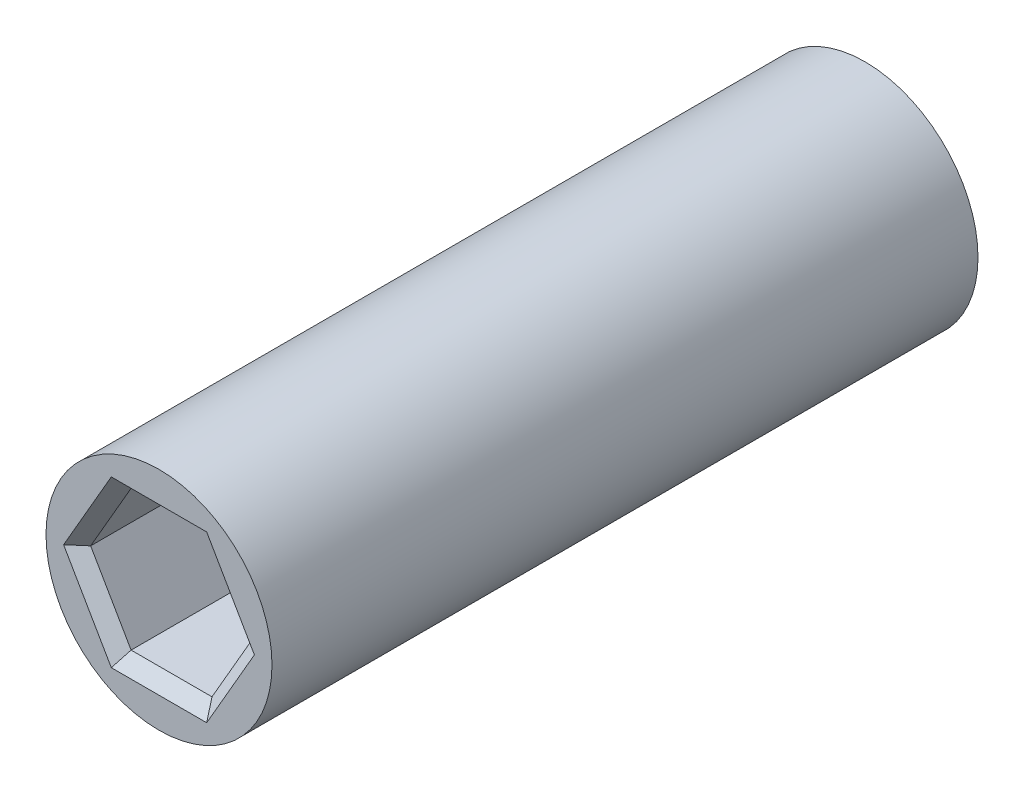
ISO-10303-21;
HEADER;
FILE_DESCRIPTION(('STEP AP214'),'2;1');
FILE_NAME('part.step','',(''),(''),'','','');
FILE_SCHEMA(('AUTOMOTIVE_DESIGN { 1 0 10303 214 1 1 1 1 }'));
ENDSEC;
DATA;
#1=APPLICATION_CONTEXT('core data for automotive mechanical design processes');
#2=APPLICATION_PROTOCOL_DEFINITION('international standard','automotive_design',2000,#1);
#3=PRODUCT_CONTEXT('',#1,'mechanical');
#4=PRODUCT('Part','Part','',(#3));
#5=PRODUCT_RELATED_PRODUCT_CATEGORY('part','',(#4));
#6=PRODUCT_DEFINITION_FORMATION('','',#4);
#7=PRODUCT_DEFINITION_CONTEXT('part definition',#1,'design');
#8=PRODUCT_DEFINITION('design','',#6,#7);
#9=PRODUCT_DEFINITION_SHAPE('','',#8);
#10=(LENGTH_UNIT() NAMED_UNIT(*) SI_UNIT(.MILLI.,.METRE.));
#11=(NAMED_UNIT(*) PLANE_ANGLE_UNIT() SI_UNIT($,.RADIAN.));
#12=(NAMED_UNIT(*) SI_UNIT($,.STERADIAN.) SOLID_ANGLE_UNIT());
#13=UNCERTAINTY_MEASURE_WITH_UNIT(LENGTH_MEASURE(1.E-05),#10,'distance_accuracy_value','');
#14=(GEOMETRIC_REPRESENTATION_CONTEXT(3) GLOBAL_UNCERTAINTY_ASSIGNED_CONTEXT((#13)) GLOBAL_UNIT_ASSIGNED_CONTEXT((#10,
#11,#12)) REPRESENTATION_CONTEXT('',''));
#15=CARTESIAN_POINT('',(0.,0.,0.));
#16=DIRECTION('',(0.,0.,1.));
#17=DIRECTION('',(1.,0.,0.));
#18=AXIS2_PLACEMENT_3D('',#15,#16,#17);
#19=CARTESIAN_POINT('',(0.,0.,0.));
#20=DIRECTION('',(0.,0.,1.));
#21=DIRECTION('',(1.,0.,0.));
#22=AXIS2_PLACEMENT_3D('',#19,#20,#21);
#23=CYLINDRICAL_SURFACE('',#22,4.5);
#24=CARTESIAN_POINT('',(0.,0.,-17.5));
#25=DIRECTION('',(0.,0.,1.));
#26=DIRECTION('',(1.,0.,0.));
#27=AXIS2_PLACEMENT_3D('',#24,#25,#26);
#28=CIRCLE('',#27,4.5);
#29=CARTESIAN_POINT('',(4.5,0.,-17.5));
#30=VERTEX_POINT('',#29);
#31=EDGE_CURVE('E257',#30,#30,#28,.T.);
#32=ORIENTED_EDGE('',*,*,#31,.F.);
#33=EDGE_LOOP('',(#32));
#34=FACE_BOUND('',#33,.T.);
#35=CARTESIAN_POINT('',(0.,0.,-45.61709914));
#36=DIRECTION('',(0.,0.,1.));
#37=DIRECTION('',(1.,0.,0.));
#38=AXIS2_PLACEMENT_3D('',#35,#36,#37);
#39=CIRCLE('',#38,4.5);
#40=CARTESIAN_POINT('',(4.5,0.,-45.61709914));
#41=VERTEX_POINT('',#40);
#42=EDGE_CURVE('E240',#41,#41,#39,.T.);
#43=ORIENTED_EDGE('',*,*,#42,.T.);
#44=EDGE_LOOP('',(#43));
#45=FACE_BOUND('',#44,.T.);
#46=ADVANCED_FACE('F43',(#34,#45),#23,.T.);
#47=CARTESIAN_POINT('',(0.,0.,-17.5));
#48=DIRECTION('',(0.,0.,1.));
#49=DIRECTION('',(1.,0.,0.));
#50=AXIS2_PLACEMENT_3D('',#47,#48,#49);
#51=PLANE('',#50);
#52=DIRECTION('',(1.,0.,0.));
#53=VECTOR('',#52,1.);
#54=CARTESIAN_POINT('',(1.61080725103906,3.29000000000001,-17.5));
#55=LINE('',#54,#53);
#56=CARTESIAN_POINT('',(-1.89948238563387,3.29000000000001,-17.5));
#57=VERTEX_POINT('',#56);
#58=CARTESIAN_POINT('',(1.89948238563387,3.29000000000001,-17.5));
#59=VERTEX_POINT('',#58);
#60=EDGE_CURVE('E263',#57,#59,#55,.T.);
#61=ORIENTED_EDGE('',*,*,#60,.T.);
#62=DIRECTION('',(0.5,-0.866025403784439,0.));
#63=VECTOR('',#62,1.);
#64=CARTESIAN_POINT('',(3.65462720397034,0.250000000000004,-17.5));
#65=LINE('',#64,#63);
#66=CARTESIAN_POINT('',(3.79896477126775,0.,-17.5));
#67=VERTEX_POINT('',#66);
#68=EDGE_CURVE('E273',#59,#67,#65,.T.);
#69=ORIENTED_EDGE('',*,*,#68,.T.);
#70=DIRECTION('',(-0.5,-0.866025403784439,0.));
#71=VECTOR('',#70,1.);
#72=CARTESIAN_POINT('',(2.04381995293128,-3.04,-17.5));
#73=LINE('',#72,#71);
#74=CARTESIAN_POINT('',(1.89948238563387,-3.29000000000001,-17.5));
#75=VERTEX_POINT('',#74);
#76=EDGE_CURVE('E271',#67,#75,#73,.T.);
#77=ORIENTED_EDGE('',*,*,#76,.T.);
#78=DIRECTION('',(-1.,0.,0.));
#79=VECTOR('',#78,1.);
#80=CARTESIAN_POINT('',(-1.61080725103905,-3.29000000000001,-17.5));
#81=LINE('',#80,#79);
#82=CARTESIAN_POINT('',(-1.89948238563387,-3.29000000000001,-17.5));
#83=VERTEX_POINT('',#82);
#84=EDGE_CURVE('E269',#75,#83,#81,.T.);
#85=ORIENTED_EDGE('',*,*,#84,.T.);
#86=DIRECTION('',(-0.5,0.866025403784439,0.));
#87=VECTOR('',#86,1.);
#88=CARTESIAN_POINT('',(-3.65462720397034,-0.250000000000005,-17.5));
#89=LINE('',#88,#87);
#90=CARTESIAN_POINT('',(-3.79896477126775,0.,-17.5));
#91=VERTEX_POINT('',#90);
#92=EDGE_CURVE('E267',#83,#91,#89,.T.);
#93=ORIENTED_EDGE('',*,*,#92,.T.);
#94=DIRECTION('',(0.5,0.866025403784439,0.));
#95=VECTOR('',#94,1.);
#96=CARTESIAN_POINT('',(-2.04381995293128,3.04,-17.5));
#97=LINE('',#96,#95);
#98=EDGE_CURVE('E265',#91,#57,#97,.T.);
#99=ORIENTED_EDGE('',*,*,#98,.T.);
#100=EDGE_LOOP('',(#61,#69,#77,#85,#93,#99));
#101=FACE_BOUND('',#100,.T.);
#102=ORIENTED_EDGE('',*,*,#31,.T.);
#103=EDGE_LOOP('',(#102));
#104=FACE_BOUND('',#103,.T.);
#105=ADVANCED_FACE('F374',(#101,#104),#51,.T.);
#106=CARTESIAN_POINT('',(-4.5,0.,-45.61709914));
#107=DIRECTION('',(0.,0.,-1.));
#108=DIRECTION('',(-1.,0.,0.));
#109=AXIS2_PLACEMENT_3D('',#106,#107,#108);
#110=PLANE('',#109);
#111=DIRECTION('',(-0.5,0.866025403784439,0.));
#112=VECTOR('',#111,1.);
#113=CARTESIAN_POINT('',(2.04381995293127,3.04,-45.61709914));
#114=LINE('',#113,#112);
#115=CARTESIAN_POINT('',(3.79896477126773,0.,-45.61709914));
#116=VERTEX_POINT('',#115);
#117=CARTESIAN_POINT('',(1.89948238563387,3.28999999999999,-45.61709914));
#118=VERTEX_POINT('',#117);
#119=EDGE_CURVE('E288',#116,#118,#114,.T.);
#120=ORIENTED_EDGE('',*,*,#119,.T.);
#121=DIRECTION('',(-1.,0.,0.));
#122=VECTOR('',#121,1.);
#123=CARTESIAN_POINT('',(-1.61080725103906,3.28999999999999,-45.61709914));
#124=LINE('',#123,#122);
#125=CARTESIAN_POINT('',(-1.89948238563387,3.28999999999999,-45.61709914));
#126=VERTEX_POINT('',#125);
#127=EDGE_CURVE('E298',#118,#126,#124,.T.);
#128=ORIENTED_EDGE('',*,*,#127,.T.);
#129=DIRECTION('',(-0.5,-0.866025403784439,0.));
#130=VECTOR('',#129,1.);
#131=CARTESIAN_POINT('',(-3.65462720397033,0.249999999999996,-45.61709914));
#132=LINE('',#131,#130);
#133=CARTESIAN_POINT('',(-3.79896477126773,0.,-45.61709914));
#134=VERTEX_POINT('',#133);
#135=EDGE_CURVE('E296',#126,#134,#132,.T.);
#136=ORIENTED_EDGE('',*,*,#135,.T.);
#137=DIRECTION('',(0.5,-0.866025403784439,0.));
#138=VECTOR('',#137,1.);
#139=CARTESIAN_POINT('',(-2.04381995293127,-3.04,-45.61709914));
#140=LINE('',#139,#138);
#141=CARTESIAN_POINT('',(-1.89948238563387,-3.28999999999999,-45.61709914));
#142=VERTEX_POINT('',#141);
#143=EDGE_CURVE('E294',#134,#142,#140,.T.);
#144=ORIENTED_EDGE('',*,*,#143,.T.);
#145=DIRECTION('',(1.,0.,0.));
#146=VECTOR('',#145,1.);
#147=CARTESIAN_POINT('',(1.61080725103905,-3.29,-45.61709914));
#148=LINE('',#147,#146);
#149=CARTESIAN_POINT('',(1.89948238563386,-3.29,-45.61709914));
#150=VERTEX_POINT('',#149);
#151=EDGE_CURVE('E292',#142,#150,#148,.T.);
#152=ORIENTED_EDGE('',*,*,#151,.T.);
#153=DIRECTION('',(0.5,0.866025403784439,0.));
#154=VECTOR('',#153,1.);
#155=CARTESIAN_POINT('',(3.65462720397033,-0.249999999999999,-45.61709914));
#156=LINE('',#155,#154);
#157=EDGE_CURVE('E290',#150,#116,#156,.T.);
#158=ORIENTED_EDGE('',*,*,#157,.T.);
#159=EDGE_LOOP('',(#120,#128,#136,#144,#152,#158));
#160=FACE_BOUND('',#159,.T.);
#161=ORIENTED_EDGE('',*,*,#42,.F.);
#162=EDGE_LOOP('',(#161));
#163=FACE_BOUND('',#162,.T.);
#164=ADVANCED_FACE('F344',(#160,#163),#110,.T.);
#165=CARTESIAN_POINT('',(3.22161450207811,0.,-24.5));
#166=DIRECTION('',(0.866025403784438,0.5,0.));
#167=DIRECTION('',(-0.5,0.866025403784439,0.));
#168=AXIS2_PLACEMENT_3D('',#165,#166,#167);
#169=PLANE('',#168);
#170=DIRECTION('',(0.,0.,1.));
#171=VECTOR('',#170,1.);
#172=CARTESIAN_POINT('',(3.22161450207811,0.,-24.5));
#173=LINE('',#172,#171);
#174=CARTESIAN_POINT('',(3.22161450207811,0.,-24.5));
#175=VERTEX_POINT('',#174);
#176=CARTESIAN_POINT('',(3.22161450207811,0.,-18.));
#177=VERTEX_POINT('',#176);
#178=EDGE_CURVE('E237',#175,#177,#173,.T.);
#179=ORIENTED_EDGE('',*,*,#178,.T.);
#180=DIRECTION('',(-0.5,0.866025403784439,0.));
#181=VECTOR('',#180,1.);
#182=CARTESIAN_POINT('',(1.61080725103906,2.79,-18.));
#183=LINE('',#182,#181);
#184=CARTESIAN_POINT('',(1.61080725103906,2.79,-18.));
#185=VERTEX_POINT('',#184);
#186=EDGE_CURVE('E260',#177,#185,#183,.T.);
#187=ORIENTED_EDGE('',*,*,#186,.T.);
#188=DIRECTION('',(0.,0.,1.));
#189=VECTOR('',#188,1.);
#190=CARTESIAN_POINT('',(1.61080725103906,2.79,-24.5));
#191=LINE('',#190,#189);
#192=CARTESIAN_POINT('',(1.61080725103906,2.79,-24.5));
#193=VERTEX_POINT('',#192);
#194=EDGE_CURVE('E236',#193,#185,#191,.T.);
#195=ORIENTED_EDGE('',*,*,#194,.F.);
#196=DIRECTION('',(-0.5,0.866025403784438,0.));
#197=VECTOR('',#196,1.);
#198=CARTESIAN_POINT('',(3.22161450207811,0.,-24.5));
#199=LINE('',#198,#197);
#200=EDGE_CURVE('E210',#175,#193,#199,.T.);
#201=ORIENTED_EDGE('',*,*,#200,.F.);
#202=EDGE_LOOP('',(#179,#187,#195,#201));
#203=FACE_BOUND('',#202,.T.);
#204=ADVANCED_FACE('F587',(#203),#169,.F.);
#205=CARTESIAN_POINT('',(1.61080725103906,-2.79,-24.5));
#206=DIRECTION('',(0.866025403784439,-0.5,0.));
#207=DIRECTION('',(0.5,0.866025403784439,0.));
#208=AXIS2_PLACEMENT_3D('',#205,#206,#207);
#209=PLANE('',#208);
#210=DIRECTION('',(0.,0.,1.));
#211=VECTOR('',#210,1.);
#212=CARTESIAN_POINT('',(1.61080725103906,-2.79,-24.5));
#213=LINE('',#212,#211);
#214=CARTESIAN_POINT('',(1.61080725103906,-2.79,-24.5));
#215=VERTEX_POINT('',#214);
#216=CARTESIAN_POINT('',(1.61080725103906,-2.79,-18.));
#217=VERTEX_POINT('',#216);
#218=EDGE_CURVE('E241',#215,#217,#213,.T.);
#219=ORIENTED_EDGE('',*,*,#218,.T.);
#220=DIRECTION('',(0.5,0.866025403784439,0.));
#221=VECTOR('',#220,1.);
#222=CARTESIAN_POINT('',(3.22161450207811,0.,-18.));
#223=LINE('',#222,#221);
#224=EDGE_CURVE('E276',#217,#177,#223,.T.);
#225=ORIENTED_EDGE('',*,*,#224,.T.);
#226=ORIENTED_EDGE('',*,*,#178,.F.);
#227=DIRECTION('',(0.5,0.866025403784439,0.));
#228=VECTOR('',#227,1.);
#229=CARTESIAN_POINT('',(1.61080725103906,-2.79,-24.5));
#230=LINE('',#229,#228);
#231=EDGE_CURVE('E233',#215,#175,#230,.T.);
#232=ORIENTED_EDGE('',*,*,#231,.F.);
#233=EDGE_LOOP('',(#219,#225,#226,#232));
#234=FACE_BOUND('',#233,.T.);
#235=ADVANCED_FACE('F577',(#234),#209,.F.);
#236=CARTESIAN_POINT('',(-1.61080725103905,-2.79,-24.5));
#237=DIRECTION('',(0.,-1.,0.));
#238=DIRECTION('',(1.,0.,0.));
#239=AXIS2_PLACEMENT_3D('',#236,#237,#238);
#240=PLANE('',#239);
#241=DIRECTION('',(0.,0.,1.));
#242=VECTOR('',#241,1.);
#243=CARTESIAN_POINT('',(-1.61080725103905,-2.79,-24.5));
#244=LINE('',#243,#242);
#245=CARTESIAN_POINT('',(-1.61080725103905,-2.79,-24.5));
#246=VERTEX_POINT('',#245);
#247=CARTESIAN_POINT('',(-1.61080725103905,-2.79,-18.));
#248=VERTEX_POINT('',#247);
#249=EDGE_CURVE('E244',#246,#248,#244,.T.);
#250=ORIENTED_EDGE('',*,*,#249,.T.);
#251=DIRECTION('',(1.,0.,0.));
#252=VECTOR('',#251,1.);
#253=CARTESIAN_POINT('',(1.61080725103906,-2.79,-18.));
#254=LINE('',#253,#252);
#255=EDGE_CURVE('E278',#248,#217,#254,.T.);
#256=ORIENTED_EDGE('',*,*,#255,.T.);
#257=ORIENTED_EDGE('',*,*,#218,.F.);
#258=DIRECTION('',(1.,0.,0.));
#259=VECTOR('',#258,1.);
#260=CARTESIAN_POINT('',(-1.61080725103905,-2.79,-24.5));
#261=LINE('',#260,#259);
#262=EDGE_CURVE('E230',#246,#215,#261,.T.);
#263=ORIENTED_EDGE('',*,*,#262,.F.);
#264=EDGE_LOOP('',(#250,#256,#257,#263));
#265=FACE_BOUND('',#264,.T.);
#266=ADVANCED_FACE('F567',(#265),#240,.F.);
#267=CARTESIAN_POINT('',(-3.22161450207811,0.,-24.5));
#268=DIRECTION('',(-0.866025403784438,-0.5,0.));
#269=DIRECTION('',(0.5,-0.866025403784439,0.));
#270=AXIS2_PLACEMENT_3D('',#267,#268,#269);
#271=PLANE('',#270);
#272=DIRECTION('',(0.,0.,1.));
#273=VECTOR('',#272,1.);
#274=CARTESIAN_POINT('',(-3.22161450207811,0.,-24.5));
#275=LINE('',#274,#273);
#276=CARTESIAN_POINT('',(-3.22161450207811,0.,-24.5));
#277=VERTEX_POINT('',#276);
#278=CARTESIAN_POINT('',(-3.22161450207811,0.,-18.));
#279=VERTEX_POINT('',#278);
#280=EDGE_CURVE('E247',#277,#279,#275,.T.);
#281=ORIENTED_EDGE('',*,*,#280,.T.);
#282=DIRECTION('',(0.5,-0.866025403784439,0.));
#283=VECTOR('',#282,1.);
#284=CARTESIAN_POINT('',(-1.61080725103905,-2.79,-18.));
#285=LINE('',#284,#283);
#286=EDGE_CURVE('E280',#279,#248,#285,.T.);
#287=ORIENTED_EDGE('',*,*,#286,.T.);
#288=ORIENTED_EDGE('',*,*,#249,.F.);
#289=DIRECTION('',(0.5,-0.866025403784439,0.));
#290=VECTOR('',#289,1.);
#291=CARTESIAN_POINT('',(-3.22161450207811,0.,-24.5));
#292=LINE('',#291,#290);
#293=EDGE_CURVE('E227',#277,#246,#292,.T.);
#294=ORIENTED_EDGE('',*,*,#293,.F.);
#295=EDGE_LOOP('',(#281,#287,#288,#294));
#296=FACE_BOUND('',#295,.T.);
#297=ADVANCED_FACE('F557',(#296),#271,.F.);
#298=CARTESIAN_POINT('',(-1.61080725103906,2.79,-24.5));
#299=DIRECTION('',(-0.866025403784439,0.5,0.));
#300=DIRECTION('',(-0.5,-0.866025403784439,0.));
#301=AXIS2_PLACEMENT_3D('',#298,#299,#300);
#302=PLANE('',#301);
#303=DIRECTION('',(0.,0.,1.));
#304=VECTOR('',#303,1.);
#305=CARTESIAN_POINT('',(-1.61080725103906,2.79,-24.5));
#306=LINE('',#305,#304);
#307=CARTESIAN_POINT('',(-1.61080725103906,2.79,-24.5));
#308=VERTEX_POINT('',#307);
#309=CARTESIAN_POINT('',(-1.61080725103906,2.79,-18.));
#310=VERTEX_POINT('',#309);
#311=EDGE_CURVE('E250',#308,#310,#306,.T.);
#312=ORIENTED_EDGE('',*,*,#311,.T.);
#313=DIRECTION('',(-0.5,-0.866025403784439,0.));
#314=VECTOR('',#313,1.);
#315=CARTESIAN_POINT('',(-3.22161450207811,0.,-18.));
#316=LINE('',#315,#314);
#317=EDGE_CURVE('E282',#310,#279,#316,.T.);
#318=ORIENTED_EDGE('',*,*,#317,.T.);
#319=ORIENTED_EDGE('',*,*,#280,.F.);
#320=DIRECTION('',(-0.5,-0.866025403784439,0.));
#321=VECTOR('',#320,1.);
#322=CARTESIAN_POINT('',(-1.61080725103906,2.79,-24.5));
#323=LINE('',#322,#321);
#324=EDGE_CURVE('E224',#308,#277,#323,.T.);
#325=ORIENTED_EDGE('',*,*,#324,.F.);
#326=EDGE_LOOP('',(#312,#318,#319,#325));
#327=FACE_BOUND('',#326,.T.);
#328=ADVANCED_FACE('F547',(#327),#302,.F.);
#329=CARTESIAN_POINT('',(1.61080725103906,2.79,-24.5));
#330=DIRECTION('',(0.,1.,0.));
#331=DIRECTION('',(0.,0.,1.));
#332=AXIS2_PLACEMENT_3D('',#329,#330,#331);
#333=PLANE('',#332);
#334=ORIENTED_EDGE('',*,*,#194,.T.);
#335=DIRECTION('',(-1.,0.,0.));
#336=VECTOR('',#335,1.);
#337=CARTESIAN_POINT('',(-1.61080725103906,2.79,-18.));
#338=LINE('',#337,#336);
#339=EDGE_CURVE('E284',#185,#310,#338,.T.);
#340=ORIENTED_EDGE('',*,*,#339,.T.);
#341=ORIENTED_EDGE('',*,*,#311,.F.);
#342=DIRECTION('',(-1.,0.,0.));
#343=VECTOR('',#342,1.);
#344=CARTESIAN_POINT('',(1.61080725103906,2.79,-24.5));
#345=LINE('',#344,#343);
#346=EDGE_CURVE('E221',#193,#308,#345,.T.);
#347=ORIENTED_EDGE('',*,*,#346,.F.);
#348=EDGE_LOOP('',(#334,#340,#341,#347));
#349=FACE_BOUND('',#348,.T.);
#350=ADVANCED_FACE('F537',(#349),#333,.F.);
#351=CARTESIAN_POINT('',(0.,0.,-24.5));
#352=DIRECTION('',(0.,0.,1.));
#353=DIRECTION('',(1.,0.,0.));
#354=AXIS2_PLACEMENT_3D('',#351,#352,#353);
#355=PLANE('',#354);
#356=ORIENTED_EDGE('',*,*,#200,.T.);
#357=ORIENTED_EDGE('',*,*,#346,.T.);
#358=ORIENTED_EDGE('',*,*,#324,.T.);
#359=ORIENTED_EDGE('',*,*,#293,.T.);
#360=ORIENTED_EDGE('',*,*,#262,.T.);
#361=ORIENTED_EDGE('',*,*,#231,.T.);
#362=EDGE_LOOP('',(#356,#357,#358,#359,#360,#361));
#363=FACE_BOUND('',#362,.T.);
#364=ADVANCED_FACE('F370',(#363),#355,.T.);
#365=CARTESIAN_POINT('',(-3.22161450207811,0.,-38.61709914));
#366=DIRECTION('',(-0.866025403784439,0.5,0.));
#367=DIRECTION('',(-0.5,-0.866025403784439,0.));
#368=AXIS2_PLACEMENT_3D('',#365,#366,#367);
#369=PLANE('',#368);
#370=DIRECTION('',(0.,0.,-1.));
#371=VECTOR('',#370,1.);
#372=CARTESIAN_POINT('',(-3.22161450207811,0.,-38.61709914));
#373=LINE('',#372,#371);
#374=CARTESIAN_POINT('',(-3.22161450207811,0.,-38.61709914));
#375=VERTEX_POINT('',#374);
#376=CARTESIAN_POINT('',(-3.22161450207811,0.,-45.11709914));
#377=VERTEX_POINT('',#376);
#378=EDGE_CURVE('E208',#375,#377,#373,.T.);
#379=ORIENTED_EDGE('',*,*,#378,.T.);
#380=DIRECTION('',(0.5,0.866025403784439,0.));
#381=VECTOR('',#380,1.);
#382=CARTESIAN_POINT('',(-1.61080725103906,2.79,-45.11709914));
#383=LINE('',#382,#381);
#384=CARTESIAN_POINT('',(-1.61080725103906,2.79,-45.11709914));
#385=VERTEX_POINT('',#384);
#386=EDGE_CURVE('E177',#377,#385,#383,.T.);
#387=ORIENTED_EDGE('',*,*,#386,.T.);
#388=DIRECTION('',(0.,0.,-1.));
#389=VECTOR('',#388,1.);
#390=CARTESIAN_POINT('',(-1.61080725103906,2.79,-38.61709914));
#391=LINE('',#390,#389);
#392=CARTESIAN_POINT('',(-1.61080725103906,2.79,-38.61709914));
#393=VERTEX_POINT('',#392);
#394=EDGE_CURVE('E169',#393,#385,#391,.T.);
#395=ORIENTED_EDGE('',*,*,#394,.F.);
#396=DIRECTION('',(0.5,0.866025403784439,0.));
#397=VECTOR('',#396,1.);
#398=CARTESIAN_POINT('',(-3.22161450207811,0.,-38.61709914));
#399=LINE('',#398,#397);
#400=EDGE_CURVE('E174',#375,#393,#399,.T.);
#401=ORIENTED_EDGE('',*,*,#400,.F.);
#402=EDGE_LOOP('',(#379,#387,#395,#401));
#403=FACE_BOUND('',#402,.T.);
#404=ADVANCED_FACE('F172',(#403),#369,.F.);
#405=CARTESIAN_POINT('',(-1.61080725103906,-2.79,-38.61709914));
#406=DIRECTION('',(-0.866025403784439,-0.5,0.));
#407=DIRECTION('',(0.5,-0.866025403784439,0.));
#408=AXIS2_PLACEMENT_3D('',#405,#406,#407);
#409=PLANE('',#408);
#410=DIRECTION('',(0.,0.,-1.));
#411=VECTOR('',#410,1.);
#412=CARTESIAN_POINT('',(-1.61080725103906,-2.79,-38.61709914));
#413=LINE('',#412,#411);
#414=CARTESIAN_POINT('',(-1.61080725103906,-2.79,-38.61709914));
#415=VERTEX_POINT('',#414);
#416=CARTESIAN_POINT('',(-1.61080725103906,-2.79,-45.11709914));
#417=VERTEX_POINT('',#416);
#418=EDGE_CURVE('E211',#415,#417,#413,.T.);
#419=ORIENTED_EDGE('',*,*,#418,.T.);
#420=DIRECTION('',(-0.5,0.866025403784439,0.));
#421=VECTOR('',#420,1.);
#422=CARTESIAN_POINT('',(-3.22161450207811,0.,-45.11709914));
#423=LINE('',#422,#421);
#424=EDGE_CURVE('E302',#417,#377,#423,.T.);
#425=ORIENTED_EDGE('',*,*,#424,.T.);
#426=ORIENTED_EDGE('',*,*,#378,.F.);
#427=DIRECTION('',(-0.5,0.866025403784439,0.));
#428=VECTOR('',#427,1.);
#429=CARTESIAN_POINT('',(-1.61080725103906,-2.79,-38.61709914));
#430=LINE('',#429,#428);
#431=EDGE_CURVE('E182',#415,#375,#430,.T.);
#432=ORIENTED_EDGE('',*,*,#431,.F.);
#433=EDGE_LOOP('',(#419,#425,#426,#432));
#434=FACE_BOUND('',#433,.T.);
#435=ADVANCED_FACE('F362',(#434),#409,.F.);
#436=CARTESIAN_POINT('',(1.61080725103905,-2.79,-38.61709914));
#437=DIRECTION('',(0.,-1.,0.));
#438=DIRECTION('',(1.,0.,0.));
#439=AXIS2_PLACEMENT_3D('',#436,#437,#438);
#440=PLANE('',#439);
#441=DIRECTION('',(0.,0.,-1.));
#442=VECTOR('',#441,1.);
#443=CARTESIAN_POINT('',(1.61080725103905,-2.79,-38.61709914));
#444=LINE('',#443,#442);
#445=CARTESIAN_POINT('',(1.61080725103905,-2.79,-38.61709914));
#446=VERTEX_POINT('',#445);
#447=CARTESIAN_POINT('',(1.61080725103905,-2.79,-45.11709914));
#448=VERTEX_POINT('',#447);
#449=EDGE_CURVE('E214',#446,#448,#444,.T.);
#450=ORIENTED_EDGE('',*,*,#449,.T.);
#451=DIRECTION('',(-1.,0.,0.));
#452=VECTOR('',#451,1.);
#453=CARTESIAN_POINT('',(-1.61080725103906,-2.79,-45.11709914));
#454=LINE('',#453,#452);
#455=EDGE_CURVE('E304',#448,#417,#454,.T.);
#456=ORIENTED_EDGE('',*,*,#455,.T.);
#457=ORIENTED_EDGE('',*,*,#418,.F.);
#458=DIRECTION('',(-1.,0.,0.));
#459=VECTOR('',#458,1.);
#460=CARTESIAN_POINT('',(1.61080725103905,-2.79,-38.61709914));
#461=LINE('',#460,#459);
#462=EDGE_CURVE('E205',#446,#415,#461,.T.);
#463=ORIENTED_EDGE('',*,*,#462,.F.);
#464=EDGE_LOOP('',(#450,#456,#457,#463));
#465=FACE_BOUND('',#464,.T.);
#466=ADVANCED_FACE('F360',(#465),#440,.F.);
#467=CARTESIAN_POINT('',(3.22161450207811,0.,-38.61709914));
#468=DIRECTION('',(0.866025403784438,-0.5,0.));
#469=DIRECTION('',(0.5,0.866025403784438,0.));
#470=AXIS2_PLACEMENT_3D('',#467,#468,#469);
#471=PLANE('',#470);
#472=DIRECTION('',(0.,0.,-1.));
#473=VECTOR('',#472,1.);
#474=CARTESIAN_POINT('',(3.22161450207811,0.,-38.61709914));
#475=LINE('',#474,#473);
#476=CARTESIAN_POINT('',(3.22161450207811,0.,-38.61709914));
#477=VERTEX_POINT('',#476);
#478=CARTESIAN_POINT('',(3.22161450207811,0.,-45.11709914));
#479=VERTEX_POINT('',#478);
#480=EDGE_CURVE('E216',#477,#479,#475,.T.);
#481=ORIENTED_EDGE('',*,*,#480,.T.);
#482=DIRECTION('',(-0.5,-0.866025403784438,0.));
#483=VECTOR('',#482,1.);
#484=CARTESIAN_POINT('',(1.61080725103905,-2.79,-45.11709914));
#485=LINE('',#484,#483);
#486=EDGE_CURVE('E53',#479,#448,#485,.T.);
#487=ORIENTED_EDGE('',*,*,#486,.T.);
#488=ORIENTED_EDGE('',*,*,#449,.F.);
#489=DIRECTION('',(-0.5,-0.866025403784438,0.));
#490=VECTOR('',#489,1.);
#491=CARTESIAN_POINT('',(3.22161450207811,0.,-38.61709914));
#492=LINE('',#491,#490);
#493=EDGE_CURVE('E202',#477,#446,#492,.T.);
#494=ORIENTED_EDGE('',*,*,#493,.F.);
#495=EDGE_LOOP('',(#481,#487,#488,#494));
#496=FACE_BOUND('',#495,.T.);
#497=ADVANCED_FACE('F358',(#496),#471,.F.);
#498=CARTESIAN_POINT('',(1.61080725103906,2.79,-38.61709914));
#499=DIRECTION('',(0.866025403784439,0.5,0.));
#500=DIRECTION('',(-0.5,0.866025403784439,0.));
#501=AXIS2_PLACEMENT_3D('',#498,#499,#500);
#502=PLANE('',#501);
#503=DIRECTION('',(0.,0.,-1.));
#504=VECTOR('',#503,1.);
#505=CARTESIAN_POINT('',(1.61080725103906,2.79,-38.61709914));
#506=LINE('',#505,#504);
#507=CARTESIAN_POINT('',(1.61080725103906,2.79,-38.61709914));
#508=VERTEX_POINT('',#507);
#509=CARTESIAN_POINT('',(1.61080725103906,2.79,-45.11709914));
#510=VERTEX_POINT('',#509);
#511=EDGE_CURVE('E181',#508,#510,#506,.T.);
#512=ORIENTED_EDGE('',*,*,#511,.T.);
#513=DIRECTION('',(0.5,-0.866025403784439,0.));
#514=VECTOR('',#513,1.);
#515=CARTESIAN_POINT('',(3.22161450207811,0.,-45.11709914));
#516=LINE('',#515,#514);
#517=EDGE_CURVE('E11',#510,#479,#516,.T.);
#518=ORIENTED_EDGE('',*,*,#517,.T.);
#519=ORIENTED_EDGE('',*,*,#480,.F.);
#520=DIRECTION('',(0.5,-0.866025403784439,0.));
#521=VECTOR('',#520,1.);
#522=CARTESIAN_POINT('',(1.61080725103906,2.79,-38.61709914));
#523=LINE('',#522,#521);
#524=EDGE_CURVE('E190',#508,#477,#523,.T.);
#525=ORIENTED_EDGE('',*,*,#524,.F.);
#526=EDGE_LOOP('',(#512,#518,#519,#525));
#527=FACE_BOUND('',#526,.T.);
#528=ADVANCED_FACE('F355',(#527),#502,.F.);
#529=CARTESIAN_POINT('',(-1.61080725103906,2.79,-38.61709914));
#530=DIRECTION('',(0.,1.,0.));
#531=DIRECTION('',(0.,0.,1.));
#532=AXIS2_PLACEMENT_3D('',#529,#530,#531);
#533=PLANE('',#532);
#534=ORIENTED_EDGE('',*,*,#394,.T.);
#535=DIRECTION('',(1.,0.,0.));
#536=VECTOR('',#535,1.);
#537=CARTESIAN_POINT('',(1.61080725103906,2.79,-45.11709914));
#538=LINE('',#537,#536);
#539=EDGE_CURVE('E286',#385,#510,#538,.T.);
#540=ORIENTED_EDGE('',*,*,#539,.T.);
#541=ORIENTED_EDGE('',*,*,#511,.F.);
#542=DIRECTION('',(1.,0.,0.));
#543=VECTOR('',#542,1.);
#544=CARTESIAN_POINT('',(-1.61080725103906,2.79,-38.61709914));
#545=LINE('',#544,#543);
#546=EDGE_CURVE('E185',#393,#508,#545,.T.);
#547=ORIENTED_EDGE('',*,*,#546,.F.);
#548=EDGE_LOOP('',(#534,#540,#541,#547));
#549=FACE_BOUND('',#548,.T.);
#550=ADVANCED_FACE('F186',(#549),#533,.F.);
#551=CARTESIAN_POINT('',(0.,0.,-38.61709914));
#552=DIRECTION('',(0.,0.,-1.));
#553=DIRECTION('',(-1.,0.,0.));
#554=AXIS2_PLACEMENT_3D('',#551,#552,#553);
#555=PLANE('',#554);
#556=ORIENTED_EDGE('',*,*,#400,.T.);
#557=ORIENTED_EDGE('',*,*,#546,.T.);
#558=ORIENTED_EDGE('',*,*,#524,.T.);
#559=ORIENTED_EDGE('',*,*,#493,.T.);
#560=ORIENTED_EDGE('',*,*,#462,.T.);
#561=ORIENTED_EDGE('',*,*,#431,.T.);
#562=EDGE_LOOP('',(#556,#557,#558,#559,#560,#561));
#563=FACE_BOUND('',#562,.T.);
#564=ADVANCED_FACE('F192',(#563),#555,.T.);
#565=CARTESIAN_POINT('',(-3.22161450207811,0.,-18.));
#566=DIRECTION('',(0.61237243569579,0.353553390593271,0.707106781186552));
#567=DIRECTION('',(-0.5,0.866025403784439,0.));
#568=AXIS2_PLACEMENT_3D('',#565,#566,#567);
#569=PLANE('',#568);
#570=DIRECTION('',(0.755928946018459,0.,-0.654653670707972));
#571=VECTOR('',#570,1.);
#572=CARTESIAN_POINT('',(-3.22161450207811,0.,-18.));
#573=LINE('',#572,#571);
#574=EDGE_CURVE('E198',#91,#279,#573,.T.);
#575=ORIENTED_EDGE('',*,*,#574,.F.);
#576=ORIENTED_EDGE('',*,*,#92,.F.);
#577=DIRECTION('',(0.377964473009229,0.654653670707981,-0.654653670707972));
#578=VECTOR('',#577,1.);
#579=CARTESIAN_POINT('',(-1.61080725103905,-2.79,-18.));
#580=LINE('',#579,#578);
#581=EDGE_CURVE('E195',#248,#83,#580,.F.);
#582=ORIENTED_EDGE('',*,*,#581,.F.);
#583=ORIENTED_EDGE('',*,*,#286,.F.);
#584=EDGE_LOOP('',(#575,#576,#582,#583));
#585=FACE_BOUND('',#584,.T.);
#586=ADVANCED_FACE('F422',(#585),#569,.T.);
#587=CARTESIAN_POINT('',(-1.61080725103905,-2.79,-18.));
#588=DIRECTION('',(0.,0.707106781186542,0.707106781186552));
#589=DIRECTION('',(-1.,0.,0.));
#590=AXIS2_PLACEMENT_3D('',#587,#588,#589);
#591=PLANE('',#590);
#592=ORIENTED_EDGE('',*,*,#581,.T.);
#593=ORIENTED_EDGE('',*,*,#84,.F.);
#594=DIRECTION('',(-0.37796447300923,0.654653670707981,-0.654653670707972));
#595=VECTOR('',#594,1.);
#596=CARTESIAN_POINT('',(1.61080725103906,-2.79,-18.));
#597=LINE('',#596,#595);
#598=EDGE_CURVE('E314',#217,#75,#597,.F.);
#599=ORIENTED_EDGE('',*,*,#598,.F.);
#600=ORIENTED_EDGE('',*,*,#255,.F.);
#601=EDGE_LOOP('',(#592,#593,#599,#600));
#602=FACE_BOUND('',#601,.T.);
#603=ADVANCED_FACE('F415',(#602),#591,.T.);
#604=CARTESIAN_POINT('',(-1.61080725103906,2.79,-18.));
#605=DIRECTION('',(0.61237243569579,-0.353553390593271,0.707106781186553));
#606=DIRECTION('',(0.5,0.866025403784439,0.));
#607=AXIS2_PLACEMENT_3D('',#604,#605,#606);
#608=PLANE('',#607);
#609=ORIENTED_EDGE('',*,*,#574,.T.);
#610=ORIENTED_EDGE('',*,*,#317,.F.);
#611=DIRECTION('',(0.377964473009231,-0.654653670707981,-0.654653670707972));
#612=VECTOR('',#611,1.);
#613=CARTESIAN_POINT('',(-1.61080725103906,2.79,-18.));
#614=LINE('',#613,#612);
#615=EDGE_CURVE('E311',#57,#310,#614,.T.);
#616=ORIENTED_EDGE('',*,*,#615,.F.);
#617=ORIENTED_EDGE('',*,*,#98,.F.);
#618=EDGE_LOOP('',(#609,#610,#616,#617));
#619=FACE_BOUND('',#618,.T.);
#620=ADVANCED_FACE('F408',(#619),#608,.T.);
#621=CARTESIAN_POINT('',(1.61080725103906,-2.79,-18.));
#622=DIRECTION('',(-0.61237243569579,0.353553390593271,0.707106781186553));
#623=DIRECTION('',(-0.5,-0.866025403784439,0.));
#624=AXIS2_PLACEMENT_3D('',#621,#622,#623);
#625=PLANE('',#624);
#626=ORIENTED_EDGE('',*,*,#598,.T.);
#627=ORIENTED_EDGE('',*,*,#76,.F.);
#628=DIRECTION('',(-0.755928946018459,0.,-0.654653670707972));
#629=VECTOR('',#628,1.);
#630=CARTESIAN_POINT('',(3.22161450207811,0.,-18.));
#631=LINE('',#630,#629);
#632=EDGE_CURVE('E309',#177,#67,#631,.F.);
#633=ORIENTED_EDGE('',*,*,#632,.F.);
#634=ORIENTED_EDGE('',*,*,#224,.F.);
#635=EDGE_LOOP('',(#626,#627,#633,#634));
#636=FACE_BOUND('',#635,.T.);
#637=ADVANCED_FACE('F401',(#636),#625,.T.);
#638=CARTESIAN_POINT('',(1.61080725103906,2.79,-18.));
#639=DIRECTION('',(0.,-0.707106781186542,0.707106781186552));
#640=DIRECTION('',(1.,0.,0.));
#641=AXIS2_PLACEMENT_3D('',#638,#639,#640);
#642=PLANE('',#641);
#643=ORIENTED_EDGE('',*,*,#615,.T.);
#644=ORIENTED_EDGE('',*,*,#339,.F.);
#645=DIRECTION('',(0.377964473009229,0.654653670707981,0.654653670707972));
#646=VECTOR('',#645,1.);
#647=CARTESIAN_POINT('',(1.15057660788503,1.99285714285713,-18.7971428571429));
#648=LINE('',#647,#646);
#649=EDGE_CURVE('E307',#59,#185,#648,.F.);
#650=ORIENTED_EDGE('',*,*,#649,.F.);
#651=ORIENTED_EDGE('',*,*,#60,.F.);
#652=EDGE_LOOP('',(#643,#644,#650,#651));
#653=FACE_BOUND('',#652,.T.);
#654=ADVANCED_FACE('F394',(#653),#642,.T.);
#655=CARTESIAN_POINT('',(3.22161450207811,0.,-18.));
#656=DIRECTION('',(-0.61237243569579,-0.353553390593271,0.707106781186552));
#657=DIRECTION('',(0.5,-0.866025403784439,0.));
#658=AXIS2_PLACEMENT_3D('',#655,#656,#657);
#659=PLANE('',#658);
#660=ORIENTED_EDGE('',*,*,#632,.T.);
#661=ORIENTED_EDGE('',*,*,#68,.F.);
#662=ORIENTED_EDGE('',*,*,#649,.T.);
#663=ORIENTED_EDGE('',*,*,#186,.F.);
#664=EDGE_LOOP('',(#660,#661,#662,#663));
#665=FACE_BOUND('',#664,.T.);
#666=ADVANCED_FACE('F388',(#665),#659,.T.);
#667=CARTESIAN_POINT('',(1.61080725103905,-2.79,-45.11709914));
#668=DIRECTION('',(0.,0.707106781186548,-0.707106781186547));
#669=DIRECTION('',(1.,0.,0.));
#670=AXIS2_PLACEMENT_3D('',#667,#668,#669);
#671=PLANE('',#670);
#672=DIRECTION('',(-0.377964473009227,0.654653670707977,0.654653670707977));
#673=VECTOR('',#672,1.);
#674=CARTESIAN_POINT('',(1.61080725103905,-2.79,-45.11709914));
#675=LINE('',#674,#673);
#676=EDGE_CURVE('E328',#150,#448,#675,.T.);
#677=ORIENTED_EDGE('',*,*,#676,.F.);
#678=ORIENTED_EDGE('',*,*,#151,.F.);
#679=DIRECTION('',(0.377964473009227,0.654653670707977,0.654653670707977));
#680=VECTOR('',#679,1.);
#681=CARTESIAN_POINT('',(-1.61080725103906,-2.79,-45.11709914));
#682=LINE('',#681,#680);
#683=EDGE_CURVE('E48',#417,#142,#682,.F.);
#684=ORIENTED_EDGE('',*,*,#683,.F.);
#685=ORIENTED_EDGE('',*,*,#455,.F.);
#686=EDGE_LOOP('',(#677,#678,#684,#685));
#687=FACE_BOUND('',#686,.T.);
#688=ADVANCED_FACE('F46',(#687),#671,.T.);
#689=CARTESIAN_POINT('',(-1.61080725103906,-2.79,-45.11709914));
#690=DIRECTION('',(0.612372435695795,0.353553390593274,-0.707106781186547));
#691=DIRECTION('',(0.5,-0.866025403784439,0.));
#692=AXIS2_PLACEMENT_3D('',#689,#690,#691);
#693=PLANE('',#692);
#694=ORIENTED_EDGE('',*,*,#683,.T.);
#695=ORIENTED_EDGE('',*,*,#143,.F.);
#696=DIRECTION('',(0.755928946018454,0.,0.654653670707977));
#697=VECTOR('',#696,1.);
#698=CARTESIAN_POINT('',(-3.22161450207811,0.,-45.11709914));
#699=LINE('',#698,#697);
#700=EDGE_CURVE('E326',#377,#134,#699,.F.);
#701=ORIENTED_EDGE('',*,*,#700,.F.);
#702=ORIENTED_EDGE('',*,*,#424,.F.);
#703=EDGE_LOOP('',(#694,#695,#701,#702));
#704=FACE_BOUND('',#703,.T.);
#705=ADVANCED_FACE('F338',(#704),#693,.T.);
#706=CARTESIAN_POINT('',(3.22161450207811,0.,-45.11709914));
#707=DIRECTION('',(-0.612372435695794,0.353553390593274,-0.707106781186548));
#708=DIRECTION('',(0.5,0.866025403784438,0.));
#709=AXIS2_PLACEMENT_3D('',#706,#707,#708);
#710=PLANE('',#709);
#711=ORIENTED_EDGE('',*,*,#676,.T.);
#712=ORIENTED_EDGE('',*,*,#486,.F.);
#713=DIRECTION('',(-0.755928946018455,0.,0.654653670707977));
#714=VECTOR('',#713,1.);
#715=CARTESIAN_POINT('',(3.22161450207811,0.,-45.11709914));
#716=LINE('',#715,#714);
#717=EDGE_CURVE('E323',#116,#479,#716,.T.);
#718=ORIENTED_EDGE('',*,*,#717,.F.);
#719=ORIENTED_EDGE('',*,*,#157,.F.);
#720=EDGE_LOOP('',(#711,#712,#718,#719));
#721=FACE_BOUND('',#720,.T.);
#722=ADVANCED_FACE('F447',(#721),#710,.T.);
#723=CARTESIAN_POINT('',(-3.22161450207811,0.,-45.11709914));
#724=DIRECTION('',(0.612372435695794,-0.353553390593274,-0.707106781186548));
#725=DIRECTION('',(-0.5,-0.866025403784439,0.));
#726=AXIS2_PLACEMENT_3D('',#723,#724,#725);
#727=PLANE('',#726);
#728=ORIENTED_EDGE('',*,*,#700,.T.);
#729=ORIENTED_EDGE('',*,*,#135,.F.);
#730=DIRECTION('',(0.377964473009227,-0.654653670707977,0.654653670707977));
#731=VECTOR('',#730,1.);
#732=CARTESIAN_POINT('',(-1.61080725103906,2.79,-45.11709914));
#733=LINE('',#732,#731);
#734=EDGE_CURVE('E321',#385,#126,#733,.F.);
#735=ORIENTED_EDGE('',*,*,#734,.F.);
#736=ORIENTED_EDGE('',*,*,#386,.F.);
#737=EDGE_LOOP('',(#728,#729,#735,#736));
#738=FACE_BOUND('',#737,.T.);
#739=ADVANCED_FACE('F350',(#738),#727,.T.);
#740=CARTESIAN_POINT('',(1.61080725103906,2.79,-45.11709914));
#741=DIRECTION('',(-0.612372435695794,-0.353553390593273,-0.707106781186548));
#742=DIRECTION('',(-0.5,0.866025403784439,0.));
#743=AXIS2_PLACEMENT_3D('',#740,#741,#742);
#744=PLANE('',#743);
#745=ORIENTED_EDGE('',*,*,#717,.T.);
#746=ORIENTED_EDGE('',*,*,#517,.F.);
#747=DIRECTION('',(0.377964473009229,0.654653670707977,-0.654653670707977));
#748=VECTOR('',#747,1.);
#749=CARTESIAN_POINT('',(1.15057660788504,1.99285714285714,-44.3199562828571));
#750=LINE('',#749,#748);
#751=EDGE_CURVE('E319',#118,#510,#750,.F.);
#752=ORIENTED_EDGE('',*,*,#751,.F.);
#753=ORIENTED_EDGE('',*,*,#119,.F.);
#754=EDGE_LOOP('',(#745,#746,#752,#753));
#755=FACE_BOUND('',#754,.T.);
#756=ADVANCED_FACE('F435',(#755),#744,.T.);
#757=CARTESIAN_POINT('',(-1.61080725103906,2.79,-45.11709914));
#758=DIRECTION('',(0.,-0.707106781186547,-0.707106781186547));
#759=DIRECTION('',(-1.,0.,0.));
#760=AXIS2_PLACEMENT_3D('',#757,#758,#759);
#761=PLANE('',#760);
#762=ORIENTED_EDGE('',*,*,#734,.T.);
#763=ORIENTED_EDGE('',*,*,#127,.F.);
#764=ORIENTED_EDGE('',*,*,#751,.T.);
#765=ORIENTED_EDGE('',*,*,#539,.F.);
#766=EDGE_LOOP('',(#762,#763,#764,#765));
#767=FACE_BOUND('',#766,.T.);
#768=ADVANCED_FACE('F353',(#767),#761,.T.);
#769=CLOSED_SHELL('',(#46,#105,#164,#204,#235,#266,#297,#328,#350,#364,#404,#435,#466,#497,#528,
#550,#564,#586,#603,#620,#637,#654,#666,#688,#705,#722,#739,#756,#768));
#770=MANIFOLD_SOLID_BREP('B2',#769);
#771=ADVANCED_BREP_SHAPE_REPRESENTATION('',(#18,#770),#14);
#772=SHAPE_DEFINITION_REPRESENTATION(#9,#771);
ENDSEC;
END-ISO-10303-21;
